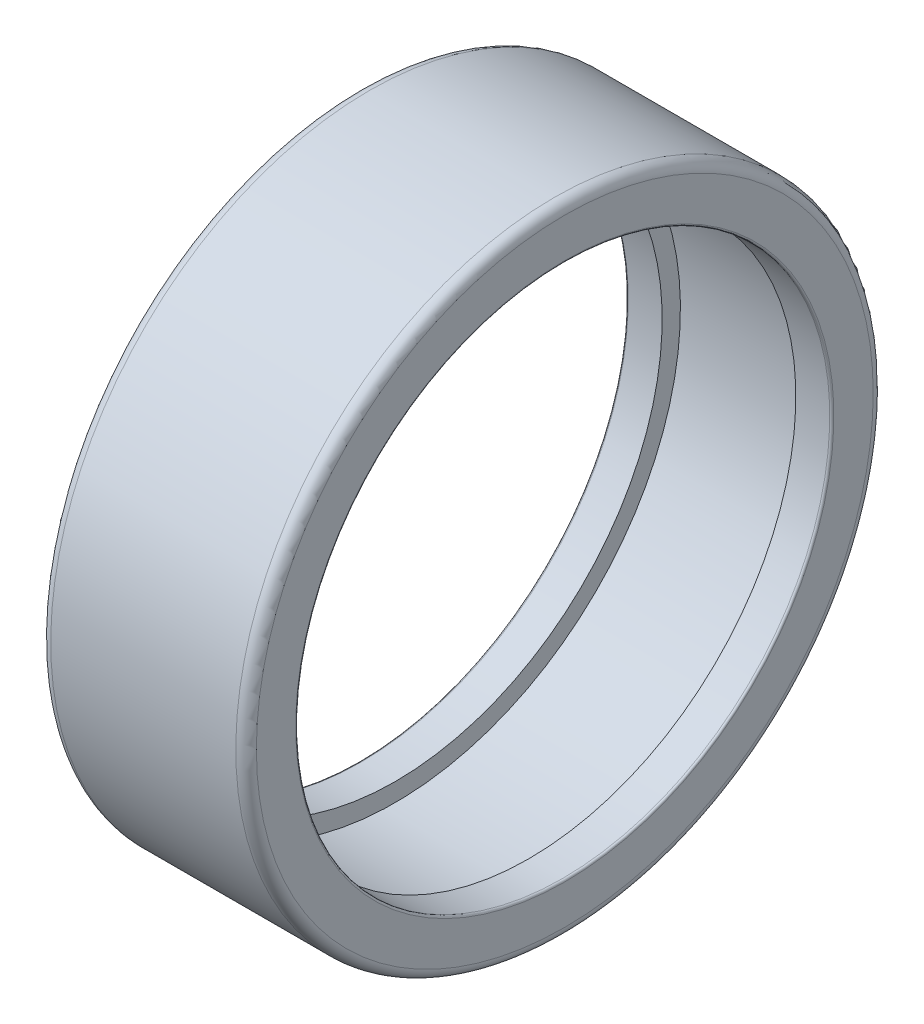
ISO-10303-21;
HEADER;
FILE_DESCRIPTION(('STEP AP214'),'2;1');
FILE_NAME('part.step','',(''),(''),'','','');
FILE_SCHEMA(('AUTOMOTIVE_DESIGN { 1 0 10303 214 1 1 1 1 }'));
ENDSEC;
DATA;
#1=APPLICATION_CONTEXT('core data for automotive mechanical design processes');
#2=APPLICATION_PROTOCOL_DEFINITION('international standard','automotive_design',2000,#1);
#3=PRODUCT_CONTEXT('',#1,'mechanical');
#4=PRODUCT('Part','Part','',(#3));
#5=PRODUCT_RELATED_PRODUCT_CATEGORY('part','',(#4));
#6=PRODUCT_DEFINITION_FORMATION('','',#4);
#7=PRODUCT_DEFINITION_CONTEXT('part definition',#1,'design');
#8=PRODUCT_DEFINITION('design','',#6,#7);
#9=PRODUCT_DEFINITION_SHAPE('','',#8);
#10=(LENGTH_UNIT() NAMED_UNIT(*) SI_UNIT(.MILLI.,.METRE.));
#11=(NAMED_UNIT(*) PLANE_ANGLE_UNIT() SI_UNIT($,.RADIAN.));
#12=(NAMED_UNIT(*) SI_UNIT($,.STERADIAN.) SOLID_ANGLE_UNIT());
#13=UNCERTAINTY_MEASURE_WITH_UNIT(LENGTH_MEASURE(1.E-05),#10,'distance_accuracy_value','');
#14=(GEOMETRIC_REPRESENTATION_CONTEXT(3) GLOBAL_UNCERTAINTY_ASSIGNED_CONTEXT((#13)) GLOBAL_UNIT_ASSIGNED_CONTEXT((#10,
#11,#12)) REPRESENTATION_CONTEXT('',''));
#15=CARTESIAN_POINT('',(0.,0.,0.));
#16=DIRECTION('',(0.,0.,1.));
#17=DIRECTION('',(1.,0.,0.));
#18=AXIS2_PLACEMENT_3D('',#15,#16,#17);
#19=CARTESIAN_POINT('',(19.8,0.,0.));
#20=DIRECTION('',(1.,0.,0.));
#21=DIRECTION('',(0.,0.,-1.));
#22=AXIS2_PLACEMENT_3D('',#19,#20,#21);
#23=TOROIDAL_SURFACE('',#22,26.175,0.2);
#24=CARTESIAN_POINT('',(20.,0.,0.));
#25=DIRECTION('',(1.,0.,0.));
#26=DIRECTION('',(0.,1.,0.));
#27=AXIS2_PLACEMENT_3D('',#24,#25,#26);
#28=CIRCLE('',#27,26.175);
#29=CARTESIAN_POINT('',(20.,26.175,0.));
#30=VERTEX_POINT('',#29);
#31=EDGE_CURVE('E11',#30,#30,#28,.T.);
#32=ORIENTED_EDGE('',*,*,#31,.T.);
#33=EDGE_LOOP('',(#32));
#34=FACE_BOUND('',#33,.T.);
#35=CARTESIAN_POINT('',(19.8,0.,0.));
#36=DIRECTION('',(1.,0.,0.));
#37=DIRECTION('',(0.,1.,0.));
#38=AXIS2_PLACEMENT_3D('',#35,#36,#37);
#39=CIRCLE('',#38,25.975);
#40=CARTESIAN_POINT('',(19.8,25.975,0.));
#41=VERTEX_POINT('',#40);
#42=EDGE_CURVE('E76',#41,#41,#39,.T.);
#43=ORIENTED_EDGE('',*,*,#42,.F.);
#44=EDGE_LOOP('',(#43));
#45=FACE_BOUND('',#44,.T.);
#46=ADVANCED_FACE('F17',(#34,#45),#23,.T.);
#47=CARTESIAN_POINT('',(20.,28.0875,0.));
#48=DIRECTION('',(1.,0.,0.));
#49=DIRECTION('',(0.,1.,0.));
#50=AXIS2_PLACEMENT_3D('',#47,#48,#49);
#51=PLANE('',#50);
#52=CARTESIAN_POINT('',(20.,0.,0.));
#53=DIRECTION('',(1.,0.,0.));
#54=DIRECTION('',(0.,1.,0.));
#55=AXIS2_PLACEMENT_3D('',#52,#53,#54);
#56=CIRCLE('',#55,30.);
#57=CARTESIAN_POINT('',(20.,30.,0.));
#58=VERTEX_POINT('',#57);
#59=EDGE_CURVE('E26',#58,#58,#56,.T.);
#60=ORIENTED_EDGE('',*,*,#59,.T.);
#61=EDGE_LOOP('',(#60));
#62=FACE_BOUND('',#61,.T.);
#63=ORIENTED_EDGE('',*,*,#31,.F.);
#64=EDGE_LOOP('',(#63));
#65=FACE_BOUND('',#64,.T.);
#66=ADVANCED_FACE('F111',(#62,#65),#51,.T.);
#67=CARTESIAN_POINT('',(19.,0.,0.));
#68=DIRECTION('',(1.,0.,0.));
#69=DIRECTION('',(0.,0.,-1.));
#70=AXIS2_PLACEMENT_3D('',#67,#68,#69);
#71=TOROIDAL_SURFACE('',#70,30.,1.);
#72=CARTESIAN_POINT('',(19.,0.,0.));
#73=DIRECTION('',(1.,0.,0.));
#74=DIRECTION('',(0.,1.,0.));
#75=AXIS2_PLACEMENT_3D('',#72,#73,#74);
#76=CIRCLE('',#75,31.);
#77=CARTESIAN_POINT('',(19.,31.,0.));
#78=VERTEX_POINT('',#77);
#79=EDGE_CURVE('E65',#78,#78,#76,.T.);
#80=ORIENTED_EDGE('',*,*,#79,.T.);
#81=EDGE_LOOP('',(#80));
#82=FACE_BOUND('',#81,.T.);
#83=ORIENTED_EDGE('',*,*,#59,.F.);
#84=EDGE_LOOP('',(#83));
#85=FACE_BOUND('',#84,.T.);
#86=ADVANCED_FACE('F116',(#82,#85),#71,.T.);
#87=CARTESIAN_POINT('',(10.,0.,0.));
#88=DIRECTION('',(-1.,0.,0.));
#89=DIRECTION('',(0.,1.,0.));
#90=AXIS2_PLACEMENT_3D('',#87,#88,#89);
#91=CYLINDRICAL_SURFACE('',#90,31.);
#92=CARTESIAN_POINT('',(1.,0.,0.));
#93=DIRECTION('',(1.,0.,0.));
#94=DIRECTION('',(0.,1.,0.));
#95=AXIS2_PLACEMENT_3D('',#92,#93,#94);
#96=CIRCLE('',#95,31.);
#97=CARTESIAN_POINT('',(1.,31.,0.));
#98=VERTEX_POINT('',#97);
#99=EDGE_CURVE('E61',#98,#98,#96,.T.);
#100=ORIENTED_EDGE('',*,*,#99,.T.);
#101=EDGE_LOOP('',(#100));
#102=FACE_BOUND('',#101,.T.);
#103=ORIENTED_EDGE('',*,*,#79,.F.);
#104=EDGE_LOOP('',(#103));
#105=FACE_BOUND('',#104,.T.);
#106=ADVANCED_FACE('F62',(#102,#105),#91,.T.);
#107=CARTESIAN_POINT('',(1.,0.,0.));
#108=DIRECTION('',(1.,0.,0.));
#109=DIRECTION('',(0.,0.,-1.));
#110=AXIS2_PLACEMENT_3D('',#107,#108,#109);
#111=TOROIDAL_SURFACE('',#110,30.,1.);
#112=CARTESIAN_POINT('',(0.,0.,0.));
#113=DIRECTION('',(1.,0.,0.));
#114=DIRECTION('',(0.,1.,0.));
#115=AXIS2_PLACEMENT_3D('',#112,#113,#114);
#116=CIRCLE('',#115,30.);
#117=CARTESIAN_POINT('',(0.,30.,0.));
#118=VERTEX_POINT('',#117);
#119=EDGE_CURVE('E66',#118,#118,#116,.T.);
#120=ORIENTED_EDGE('',*,*,#119,.T.);
#121=EDGE_LOOP('',(#120));
#122=FACE_BOUND('',#121,.T.);
#123=ORIENTED_EDGE('',*,*,#99,.F.);
#124=EDGE_LOOP('',(#123));
#125=FACE_BOUND('',#124,.T.);
#126=ADVANCED_FACE('F19',(#122,#125),#111,.T.);
#127=CARTESIAN_POINT('',(0.,28.0875,0.));
#128=DIRECTION('',(-1.,0.,0.));
#129=DIRECTION('',(0.,-1.,0.));
#130=AXIS2_PLACEMENT_3D('',#127,#128,#129);
#131=PLANE('',#130);
#132=CARTESIAN_POINT('',(0.,0.,0.));
#133=DIRECTION('',(1.,0.,0.));
#134=DIRECTION('',(0.,1.,0.));
#135=AXIS2_PLACEMENT_3D('',#132,#133,#134);
#136=CIRCLE('',#135,26.175);
#137=CARTESIAN_POINT('',(0.,26.175,0.));
#138=VERTEX_POINT('',#137);
#139=EDGE_CURVE('E69',#138,#138,#136,.T.);
#140=ORIENTED_EDGE('',*,*,#139,.T.);
#141=EDGE_LOOP('',(#140));
#142=FACE_BOUND('',#141,.T.);
#143=ORIENTED_EDGE('',*,*,#119,.F.);
#144=EDGE_LOOP('',(#143));
#145=FACE_BOUND('',#144,.T.);
#146=ADVANCED_FACE('F95',(#142,#145),#131,.T.);
#147=CARTESIAN_POINT('',(0.2,0.,0.));
#148=DIRECTION('',(1.,0.,0.));
#149=DIRECTION('',(0.,0.,-1.));
#150=AXIS2_PLACEMENT_3D('',#147,#148,#149);
#151=TOROIDAL_SURFACE('',#150,26.175,0.2);
#152=CARTESIAN_POINT('',(0.2,0.,0.));
#153=DIRECTION('',(1.,0.,0.));
#154=DIRECTION('',(0.,1.,0.));
#155=AXIS2_PLACEMENT_3D('',#152,#153,#154);
#156=CIRCLE('',#155,25.975);
#157=CARTESIAN_POINT('',(0.2,25.975,0.));
#158=VERTEX_POINT('',#157);
#159=EDGE_CURVE('E86',#158,#158,#156,.T.);
#160=ORIENTED_EDGE('',*,*,#159,.T.);
#161=EDGE_LOOP('',(#160));
#162=FACE_BOUND('',#161,.T.);
#163=ORIENTED_EDGE('',*,*,#139,.F.);
#164=EDGE_LOOP('',(#163));
#165=FACE_BOUND('',#164,.T.);
#166=ADVANCED_FACE('F98',(#162,#165),#151,.T.);
#167=CARTESIAN_POINT('',(1.85,0.,0.));
#168=DIRECTION('',(-1.,0.,0.));
#169=DIRECTION('',(0.,1.,0.));
#170=AXIS2_PLACEMENT_3D('',#167,#168,#169);
#171=CYLINDRICAL_SURFACE('',#170,25.975);
#172=CARTESIAN_POINT('',(3.5,0.,0.));
#173=DIRECTION('',(1.,0.,0.));
#174=DIRECTION('',(0.,1.,0.));
#175=AXIS2_PLACEMENT_3D('',#172,#173,#174);
#176=CIRCLE('',#175,25.975);
#177=CARTESIAN_POINT('',(3.5,25.975,0.));
#178=VERTEX_POINT('',#177);
#179=EDGE_CURVE('E79',#178,#178,#176,.T.);
#180=ORIENTED_EDGE('',*,*,#179,.T.);
#181=EDGE_LOOP('',(#180));
#182=FACE_BOUND('',#181,.T.);
#183=ORIENTED_EDGE('',*,*,#159,.F.);
#184=EDGE_LOOP('',(#183));
#185=FACE_BOUND('',#184,.T.);
#186=ADVANCED_FACE('F100',(#182,#185),#171,.F.);
#187=CARTESIAN_POINT('',(3.5,26.8625,0.));
#188=DIRECTION('',(1.,0.,0.));
#189=DIRECTION('',(0.,1.,0.));
#190=AXIS2_PLACEMENT_3D('',#187,#188,#189);
#191=PLANE('',#190);
#192=CARTESIAN_POINT('',(3.5,0.,0.));
#193=DIRECTION('',(1.,0.,0.));
#194=DIRECTION('',(0.,1.,0.));
#195=AXIS2_PLACEMENT_3D('',#192,#193,#194);
#196=CIRCLE('',#195,27.75);
#197=CARTESIAN_POINT('',(3.5,27.75,0.));
#198=VERTEX_POINT('',#197);
#199=EDGE_CURVE('E75',#198,#198,#196,.T.);
#200=ORIENTED_EDGE('',*,*,#199,.T.);
#201=EDGE_LOOP('',(#200));
#202=FACE_BOUND('',#201,.T.);
#203=ORIENTED_EDGE('',*,*,#179,.F.);
#204=EDGE_LOOP('',(#203));
#205=FACE_BOUND('',#204,.T.);
#206=ADVANCED_FACE('F106',(#202,#205),#191,.T.);
#207=CARTESIAN_POINT('',(10.,0.,0.));
#208=DIRECTION('',(-1.,0.,0.));
#209=DIRECTION('',(0.,1.,0.));
#210=AXIS2_PLACEMENT_3D('',#207,#208,#209);
#211=CYLINDRICAL_SURFACE('',#210,27.75);
#212=CARTESIAN_POINT('',(16.5,0.,0.));
#213=DIRECTION('',(1.,0.,0.));
#214=DIRECTION('',(0.,1.,0.));
#215=AXIS2_PLACEMENT_3D('',#212,#213,#214);
#216=CIRCLE('',#215,27.75);
#217=CARTESIAN_POINT('',(16.5,27.75,0.));
#218=VERTEX_POINT('',#217);
#219=EDGE_CURVE('E74',#218,#218,#216,.T.);
#220=ORIENTED_EDGE('',*,*,#219,.T.);
#221=EDGE_LOOP('',(#220));
#222=FACE_BOUND('',#221,.T.);
#223=ORIENTED_EDGE('',*,*,#199,.F.);
#224=EDGE_LOOP('',(#223));
#225=FACE_BOUND('',#224,.T.);
#226=ADVANCED_FACE('F124',(#222,#225),#211,.F.);
#227=CARTESIAN_POINT('',(16.5,26.8625,0.));
#228=DIRECTION('',(-1.,0.,0.));
#229=DIRECTION('',(0.,-1.,0.));
#230=AXIS2_PLACEMENT_3D('',#227,#228,#229);
#231=PLANE('',#230);
#232=CARTESIAN_POINT('',(16.5,0.,0.));
#233=DIRECTION('',(1.,0.,0.));
#234=DIRECTION('',(0.,1.,0.));
#235=AXIS2_PLACEMENT_3D('',#232,#233,#234);
#236=CIRCLE('',#235,25.975);
#237=CARTESIAN_POINT('',(16.5,25.975,0.));
#238=VERTEX_POINT('',#237);
#239=EDGE_CURVE('E81',#238,#238,#236,.T.);
#240=ORIENTED_EDGE('',*,*,#239,.T.);
#241=EDGE_LOOP('',(#240));
#242=FACE_BOUND('',#241,.T.);
#243=ORIENTED_EDGE('',*,*,#219,.F.);
#244=EDGE_LOOP('',(#243));
#245=FACE_BOUND('',#244,.T.);
#246=ADVANCED_FACE('F120',(#242,#245),#231,.T.);
#247=CARTESIAN_POINT('',(18.15,0.,0.));
#248=DIRECTION('',(-1.,0.,0.));
#249=DIRECTION('',(0.,1.,0.));
#250=AXIS2_PLACEMENT_3D('',#247,#248,#249);
#251=CYLINDRICAL_SURFACE('',#250,25.975);
#252=ORIENTED_EDGE('',*,*,#42,.T.);
#253=EDGE_LOOP('',(#252));
#254=FACE_BOUND('',#253,.T.);
#255=ORIENTED_EDGE('',*,*,#239,.F.);
#256=EDGE_LOOP('',(#255));
#257=FACE_BOUND('',#256,.T.);
#258=ADVANCED_FACE('F123',(#254,#257),#251,.F.);
#259=CLOSED_SHELL('',(#46,#66,#86,#106,#126,#146,#166,#186,#206,#226,#246,#258));
#260=MANIFOLD_SOLID_BREP('B1',#259);
#261=ADVANCED_BREP_SHAPE_REPRESENTATION('',(#18,#260),#14);
#262=SHAPE_DEFINITION_REPRESENTATION(#9,#261);
ENDSEC;
END-ISO-10303-21;
